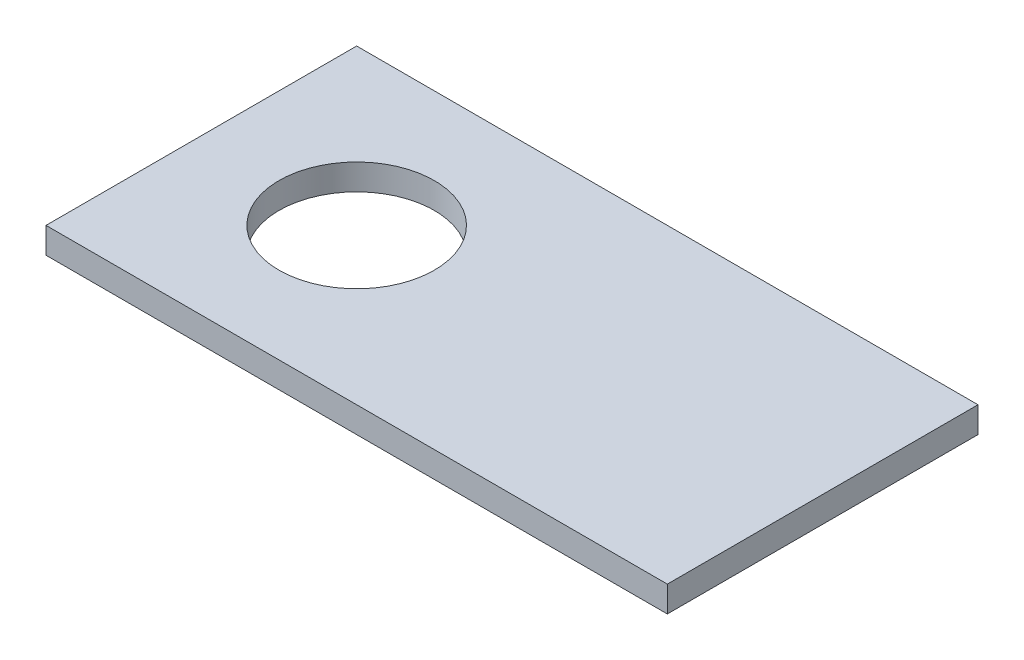
ISO-10303-21;
HEADER;
FILE_DESCRIPTION(('STEP AP214'),'2;1');
FILE_NAME('part.step','',(''),(''),'','','');
FILE_SCHEMA(('AUTOMOTIVE_DESIGN { 1 0 10303 214 1 1 1 1 }'));
ENDSEC;
DATA;
#1=APPLICATION_CONTEXT('core data for automotive mechanical design processes');
#2=APPLICATION_PROTOCOL_DEFINITION('international standard','automotive_design',2000,#1);
#3=PRODUCT_CONTEXT('',#1,'mechanical');
#4=PRODUCT('Part','Part','',(#3));
#5=PRODUCT_RELATED_PRODUCT_CATEGORY('part','',(#4));
#6=PRODUCT_DEFINITION_FORMATION('','',#4);
#7=PRODUCT_DEFINITION_CONTEXT('part definition',#1,'design');
#8=PRODUCT_DEFINITION('design','',#6,#7);
#9=PRODUCT_DEFINITION_SHAPE('','',#8);
#10=(LENGTH_UNIT() NAMED_UNIT(*) SI_UNIT(.MILLI.,.METRE.));
#11=(NAMED_UNIT(*) PLANE_ANGLE_UNIT() SI_UNIT($,.RADIAN.));
#12=(NAMED_UNIT(*) SI_UNIT($,.STERADIAN.) SOLID_ANGLE_UNIT());
#13=UNCERTAINTY_MEASURE_WITH_UNIT(LENGTH_MEASURE(1.E-05),#10,'distance_accuracy_value','');
#14=(GEOMETRIC_REPRESENTATION_CONTEXT(3) GLOBAL_UNCERTAINTY_ASSIGNED_CONTEXT((#13)) GLOBAL_UNIT_ASSIGNED_CONTEXT((#10,
#11,#12)) REPRESENTATION_CONTEXT('',''));
#15=CARTESIAN_POINT('',(0.,0.,0.));
#16=DIRECTION('',(0.,0.,1.));
#17=DIRECTION('',(1.,0.,0.));
#18=AXIS2_PLACEMENT_3D('',#15,#16,#17);
#19=CARTESIAN_POINT('',(0.,3.175,0.));
#20=DIRECTION('',(0.,1.,0.));
#21=DIRECTION('',(0.,0.,1.));
#22=AXIS2_PLACEMENT_3D('',#19,#20,#21);
#23=PLANE('',#22);
#24=DIRECTION('',(0.,0.,-1.));
#25=VECTOR('',#24,1.);
#26=CARTESIAN_POINT('',(19.05,3.175,-19.05));
#27=LINE('',#26,#25);
#28=CARTESIAN_POINT('',(19.05,3.175,19.05));
#29=VERTEX_POINT('',#28);
#30=CARTESIAN_POINT('',(19.05,3.175,-19.05));
#31=VERTEX_POINT('',#30);
#32=EDGE_CURVE('E85',#29,#31,#27,.T.);
#33=ORIENTED_EDGE('',*,*,#32,.T.);
#34=DIRECTION('',(-1.,0.,0.));
#35=VECTOR('',#34,1.);
#36=CARTESIAN_POINT('',(-57.15,3.175,-19.05));
#37=LINE('',#36,#35);
#38=CARTESIAN_POINT('',(-57.15,3.175,-19.05));
#39=VERTEX_POINT('',#38);
#40=EDGE_CURVE('E80',#31,#39,#37,.T.);
#41=ORIENTED_EDGE('',*,*,#40,.T.);
#42=DIRECTION('',(0.,0.,1.));
#43=VECTOR('',#42,1.);
#44=CARTESIAN_POINT('',(-57.15,3.175,-19.05));
#45=LINE('',#44,#43);
#46=CARTESIAN_POINT('',(-57.15,3.175,19.05));
#47=VERTEX_POINT('',#46);
#48=EDGE_CURVE('E83',#39,#47,#45,.T.);
#49=ORIENTED_EDGE('',*,*,#48,.T.);
#50=DIRECTION('',(1.,0.,0.));
#51=VECTOR('',#50,1.);
#52=CARTESIAN_POINT('',(-57.15,3.175,19.05));
#53=LINE('',#52,#51);
#54=EDGE_CURVE('E50',#47,#29,#53,.T.);
#55=ORIENTED_EDGE('',*,*,#54,.T.);
#56=EDGE_LOOP('',(#33,#41,#49,#55));
#57=FACE_BOUND('',#56,.T.);
#58=CARTESIAN_POINT('',(-38.1,3.175,0.));
#59=DIRECTION('',(0.,1.,0.));
#60=DIRECTION('',(0.,0.,1.));
#61=AXIS2_PLACEMENT_3D('',#58,#59,#60);
#62=CIRCLE('',#61,9.525);
#63=CARTESIAN_POINT('',(-38.1,3.175,9.525));
#64=VERTEX_POINT('',#63);
#65=EDGE_CURVE('E100',#64,#64,#62,.T.);
#66=ORIENTED_EDGE('',*,*,#65,.F.);
#67=EDGE_LOOP('',(#66));
#68=FACE_BOUND('',#67,.T.);
#69=ADVANCED_FACE('F33',(#57,#68),#23,.T.);
#70=CARTESIAN_POINT('',(0.,0.,0.));
#71=DIRECTION('',(0.,1.,0.));
#72=DIRECTION('',(0.,0.,1.));
#73=AXIS2_PLACEMENT_3D('',#70,#71,#72);
#74=PLANE('',#73);
#75=DIRECTION('',(0.,0.,-1.));
#76=VECTOR('',#75,1.);
#77=CARTESIAN_POINT('',(19.05,0.,-19.05));
#78=LINE('',#77,#76);
#79=CARTESIAN_POINT('',(19.05,0.,19.05));
#80=VERTEX_POINT('',#79);
#81=CARTESIAN_POINT('',(19.05,0.,-19.05));
#82=VERTEX_POINT('',#81);
#83=EDGE_CURVE('E97',#80,#82,#78,.T.);
#84=ORIENTED_EDGE('',*,*,#83,.F.);
#85=DIRECTION('',(1.,0.,0.));
#86=VECTOR('',#85,1.);
#87=CARTESIAN_POINT('',(-57.15,0.,19.05));
#88=LINE('',#87,#86);
#89=CARTESIAN_POINT('',(-57.15,0.,19.05));
#90=VERTEX_POINT('',#89);
#91=EDGE_CURVE('E73',#90,#80,#88,.T.);
#92=ORIENTED_EDGE('',*,*,#91,.F.);
#93=DIRECTION('',(0.,0.,1.));
#94=VECTOR('',#93,1.);
#95=CARTESIAN_POINT('',(-57.15,0.,-19.05));
#96=LINE('',#95,#94);
#97=CARTESIAN_POINT('',(-57.15,0.,-19.05));
#98=VERTEX_POINT('',#97);
#99=EDGE_CURVE('E67',#98,#90,#96,.T.);
#100=ORIENTED_EDGE('',*,*,#99,.F.);
#101=DIRECTION('',(-1.,0.,0.));
#102=VECTOR('',#101,1.);
#103=CARTESIAN_POINT('',(-57.15,0.,-19.05));
#104=LINE('',#103,#102);
#105=EDGE_CURVE('E89',#82,#98,#104,.T.);
#106=ORIENTED_EDGE('',*,*,#105,.F.);
#107=EDGE_LOOP('',(#84,#92,#100,#106));
#108=FACE_BOUND('',#107,.T.);
#109=CARTESIAN_POINT('',(-38.1,0.,0.));
#110=DIRECTION('',(0.,1.,0.));
#111=DIRECTION('',(0.,0.,1.));
#112=AXIS2_PLACEMENT_3D('',#109,#110,#111);
#113=CIRCLE('',#112,9.525);
#114=CARTESIAN_POINT('',(-38.1,0.,9.525));
#115=VERTEX_POINT('',#114);
#116=EDGE_CURVE('E112',#115,#115,#113,.T.);
#117=ORIENTED_EDGE('',*,*,#116,.T.);
#118=EDGE_LOOP('',(#117));
#119=FACE_BOUND('',#118,.T.);
#120=ADVANCED_FACE('F108',(#108,#119),#74,.F.);
#121=CARTESIAN_POINT('',(19.05,3.175,-19.05));
#122=DIRECTION('',(-1.,0.,0.));
#123=DIRECTION('',(0.,0.,1.));
#124=AXIS2_PLACEMENT_3D('',#121,#122,#123);
#125=PLANE('',#124);
#126=ORIENTED_EDGE('',*,*,#83,.T.);
#127=DIRECTION('',(0.,-1.,0.));
#128=VECTOR('',#127,1.);
#129=CARTESIAN_POINT('',(19.05,3.175,-19.05));
#130=LINE('',#129,#128);
#131=EDGE_CURVE('E11',#31,#82,#130,.T.);
#132=ORIENTED_EDGE('',*,*,#131,.F.);
#133=ORIENTED_EDGE('',*,*,#32,.F.);
#134=DIRECTION('',(0.,-1.,0.));
#135=VECTOR('',#134,1.);
#136=CARTESIAN_POINT('',(19.05,3.175,19.05));
#137=LINE('',#136,#135);
#138=EDGE_CURVE('E93',#29,#80,#137,.T.);
#139=ORIENTED_EDGE('',*,*,#138,.T.);
#140=EDGE_LOOP('',(#126,#132,#133,#139));
#141=FACE_BOUND('',#140,.T.);
#142=ADVANCED_FACE('F35',(#141),#125,.F.);
#143=CARTESIAN_POINT('',(-57.15,3.175,-19.05));
#144=DIRECTION('',(0.,0.,1.));
#145=DIRECTION('',(1.,0.,0.));
#146=AXIS2_PLACEMENT_3D('',#143,#144,#145);
#147=PLANE('',#146);
#148=ORIENTED_EDGE('',*,*,#105,.T.);
#149=DIRECTION('',(0.,-1.,0.));
#150=VECTOR('',#149,1.);
#151=CARTESIAN_POINT('',(-57.15,3.175,-19.05));
#152=LINE('',#151,#150);
#153=EDGE_CURVE('E42',#39,#98,#152,.T.);
#154=ORIENTED_EDGE('',*,*,#153,.F.);
#155=ORIENTED_EDGE('',*,*,#40,.F.);
#156=ORIENTED_EDGE('',*,*,#131,.T.);
#157=EDGE_LOOP('',(#148,#154,#155,#156));
#158=FACE_BOUND('',#157,.T.);
#159=ADVANCED_FACE('F88',(#158),#147,.F.);
#160=CARTESIAN_POINT('',(-57.15,3.175,-19.05));
#161=DIRECTION('',(1.,0.,0.));
#162=DIRECTION('',(0.,0.,-1.));
#163=AXIS2_PLACEMENT_3D('',#160,#161,#162);
#164=PLANE('',#163);
#165=ORIENTED_EDGE('',*,*,#99,.T.);
#166=DIRECTION('',(0.,-1.,0.));
#167=VECTOR('',#166,1.);
#168=CARTESIAN_POINT('',(-57.15,3.175,19.05));
#169=LINE('',#168,#167);
#170=EDGE_CURVE('E90',#47,#90,#169,.T.);
#171=ORIENTED_EDGE('',*,*,#170,.F.);
#172=ORIENTED_EDGE('',*,*,#48,.F.);
#173=ORIENTED_EDGE('',*,*,#153,.T.);
#174=EDGE_LOOP('',(#165,#171,#172,#173));
#175=FACE_BOUND('',#174,.T.);
#176=ADVANCED_FACE('F91',(#175),#164,.F.);
#177=CARTESIAN_POINT('',(-57.15,3.175,19.05));
#178=DIRECTION('',(0.,0.,-1.));
#179=DIRECTION('',(-1.,0.,0.));
#180=AXIS2_PLACEMENT_3D('',#177,#178,#179);
#181=PLANE('',#180);
#182=ORIENTED_EDGE('',*,*,#91,.T.);
#183=ORIENTED_EDGE('',*,*,#138,.F.);
#184=ORIENTED_EDGE('',*,*,#54,.F.);
#185=ORIENTED_EDGE('',*,*,#170,.T.);
#186=EDGE_LOOP('',(#182,#183,#184,#185));
#187=FACE_BOUND('',#186,.T.);
#188=ADVANCED_FACE('F105',(#187),#181,.F.);
#189=CARTESIAN_POINT('',(-38.1,3.175,0.));
#190=DIRECTION('',(0.,-1.,0.));
#191=DIRECTION('',(0.,0.,-1.));
#192=AXIS2_PLACEMENT_3D('',#189,#190,#191);
#193=CYLINDRICAL_SURFACE('',#192,9.525);
#194=ORIENTED_EDGE('',*,*,#65,.T.);
#195=EDGE_LOOP('',(#194));
#196=FACE_BOUND('',#195,.T.);
#197=ORIENTED_EDGE('',*,*,#116,.F.);
#198=EDGE_LOOP('',(#197));
#199=FACE_BOUND('',#198,.T.);
#200=ADVANCED_FACE('F118',(#196,#199),#193,.F.);
#201=CLOSED_SHELL('',(#69,#120,#142,#159,#176,#188,#200));
#202=MANIFOLD_SOLID_BREP('B2',#201);
#203=ADVANCED_BREP_SHAPE_REPRESENTATION('',(#18,#202),#14);
#204=SHAPE_DEFINITION_REPRESENTATION(#9,#203);
ENDSEC;
END-ISO-10303-21;
